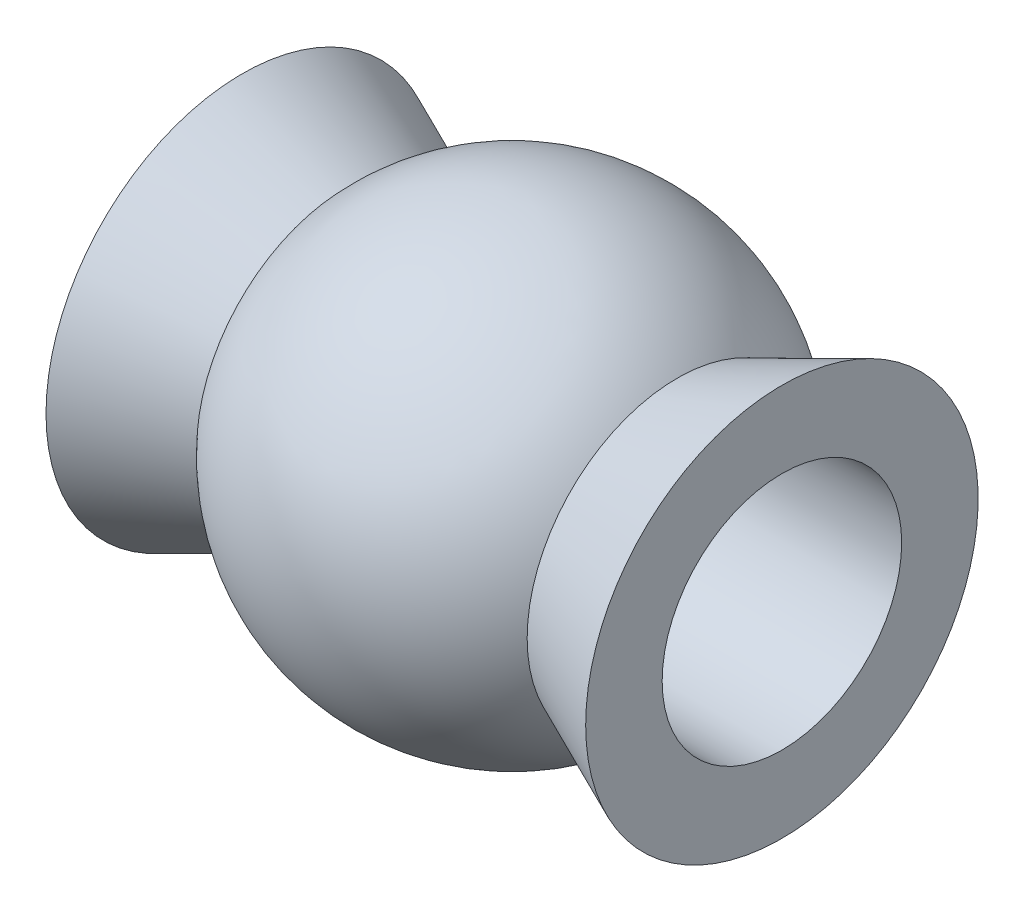
ISO-10303-21;
HEADER;
FILE_DESCRIPTION(('STEP AP214'),'2;1');
FILE_NAME('part.step','',(''),(''),'','','');
FILE_SCHEMA(('AUTOMOTIVE_DESIGN { 1 0 10303 214 1 1 1 1 }'));
ENDSEC;
DATA;
#1=APPLICATION_CONTEXT('core data for automotive mechanical design processes');
#2=APPLICATION_PROTOCOL_DEFINITION('international standard','automotive_design',2000,#1);
#3=PRODUCT_CONTEXT('',#1,'mechanical');
#4=PRODUCT('Part','Part','',(#3));
#5=PRODUCT_RELATED_PRODUCT_CATEGORY('part','',(#4));
#6=PRODUCT_DEFINITION_FORMATION('','',#4);
#7=PRODUCT_DEFINITION_CONTEXT('part definition',#1,'design');
#8=PRODUCT_DEFINITION('design','',#6,#7);
#9=PRODUCT_DEFINITION_SHAPE('','',#8);
#10=(LENGTH_UNIT() NAMED_UNIT(*) SI_UNIT(.MILLI.,.METRE.));
#11=(NAMED_UNIT(*) PLANE_ANGLE_UNIT() SI_UNIT($,.RADIAN.));
#12=(NAMED_UNIT(*) SI_UNIT($,.STERADIAN.) SOLID_ANGLE_UNIT());
#13=UNCERTAINTY_MEASURE_WITH_UNIT(LENGTH_MEASURE(1.E-05),#10,'distance_accuracy_value','');
#14=(GEOMETRIC_REPRESENTATION_CONTEXT(3) GLOBAL_UNCERTAINTY_ASSIGNED_CONTEXT((#13)) GLOBAL_UNIT_ASSIGNED_CONTEXT((#10,
#11,#12)) REPRESENTATION_CONTEXT('',''));
#15=CARTESIAN_POINT('',(0.,0.,0.));
#16=DIRECTION('',(0.,0.,1.));
#17=DIRECTION('',(1.,0.,0.));
#18=AXIS2_PLACEMENT_3D('',#15,#16,#17);
#19=CARTESIAN_POINT('',(0.,0.,0.));
#20=DIRECTION('',(-1.,0.,0.));
#21=DIRECTION('',(0.,0.,-1.));
#22=AXIS2_PLACEMENT_3D('',#19,#20,#21);
#23=SPHERICAL_SURFACE('',#22,2.88924999999999);
#24=CARTESIAN_POINT('',(-2.1382534818164,0.,0.));
#25=DIRECTION('',(-1.,0.,0.));
#26=DIRECTION('',(0.,0.,1.));
#27=AXIS2_PLACEMENT_3D('',#24,#25,#26);
#28=CIRCLE('',#27,1.9431);
#29=CARTESIAN_POINT('',(-2.1382534818164,0.,1.9431));
#30=VERTEX_POINT('',#29);
#31=EDGE_CURVE('E10',#30,#30,#28,.T.);
#32=ORIENTED_EDGE('',*,*,#31,.F.);
#33=EDGE_LOOP('',(#32));
#34=FACE_BOUND('',#33,.T.);
#35=CARTESIAN_POINT('',(2.13825348181641,0.,0.));
#36=DIRECTION('',(-1.,0.,0.));
#37=DIRECTION('',(0.,0.,1.));
#38=AXIS2_PLACEMENT_3D('',#35,#36,#37);
#39=CIRCLE('',#38,1.94309999999999);
#40=CARTESIAN_POINT('',(2.13825348181641,0.,1.94309999999999));
#41=VERTEX_POINT('',#40);
#42=EDGE_CURVE('E46',#41,#41,#39,.T.);
#43=ORIENTED_EDGE('',*,*,#42,.T.);
#44=EDGE_LOOP('',(#43));
#45=FACE_BOUND('',#44,.T.);
#46=ADVANCED_FACE('F30',(#34,#45),#23,.T.);
#47=CARTESIAN_POINT('',(-2.1382534818164,0.,0.));
#48=DIRECTION('',(-1.,0.,0.));
#49=DIRECTION('',(0.,0.,1.));
#50=AXIS2_PLACEMENT_3D('',#47,#48,#49);
#51=CONICAL_SURFACE('',#50,1.9431,0.415144850348437);
#52=CARTESIAN_POINT('',(-3.4925,0.,0.));
#53=DIRECTION('',(-1.,0.,0.));
#54=DIRECTION('',(0.,0.,1.));
#55=AXIS2_PLACEMENT_3D('',#52,#53,#54);
#56=CIRCLE('',#55,2.54);
#57=CARTESIAN_POINT('',(-3.49249999999999,0.,2.54000000000001));
#58=VERTEX_POINT('',#57);
#59=EDGE_CURVE('E37',#58,#58,#56,.T.);
#60=ORIENTED_EDGE('',*,*,#59,.F.);
#61=EDGE_LOOP('',(#60));
#62=FACE_BOUND('',#61,.T.);
#63=ORIENTED_EDGE('',*,*,#31,.T.);
#64=EDGE_LOOP('',(#63));
#65=FACE_BOUND('',#64,.T.);
#66=ADVANCED_FACE('F69',(#62,#65),#51,.T.);
#67=CARTESIAN_POINT('',(-3.4925,0.,-2.54));
#68=DIRECTION('',(1.,0.,0.));
#69=DIRECTION('',(0.,0.,-1.));
#70=AXIS2_PLACEMENT_3D('',#67,#68,#69);
#71=PLANE('',#70);
#72=CARTESIAN_POINT('',(-3.4925,0.,0.));
#73=DIRECTION('',(-1.,0.,0.));
#74=DIRECTION('',(0.,0.,1.));
#75=AXIS2_PLACEMENT_3D('',#72,#73,#74);
#76=CIRCLE('',#75,1.55);
#77=CARTESIAN_POINT('',(-3.4925,0.,1.55));
#78=VERTEX_POINT('',#77);
#79=EDGE_CURVE('E49',#78,#78,#76,.T.);
#80=ORIENTED_EDGE('',*,*,#79,.F.);
#81=EDGE_LOOP('',(#80));
#82=FACE_BOUND('',#81,.T.);
#83=ORIENTED_EDGE('',*,*,#59,.T.);
#84=EDGE_LOOP('',(#83));
#85=FACE_BOUND('',#84,.T.);
#86=ADVANCED_FACE('F74',(#82,#85),#71,.F.);
#87=CARTESIAN_POINT('',(3.49250000000001,0.,0.));
#88=DIRECTION('',(-1.,0.,0.));
#89=DIRECTION('',(0.,0.,1.));
#90=AXIS2_PLACEMENT_3D('',#87,#88,#89);
#91=PLANE('',#90);
#92=CARTESIAN_POINT('',(3.49250000000001,0.,0.));
#93=DIRECTION('',(-1.,0.,0.));
#94=DIRECTION('',(0.,0.,1.));
#95=AXIS2_PLACEMENT_3D('',#92,#93,#94);
#96=CIRCLE('',#95,1.55);
#97=CARTESIAN_POINT('',(3.49250000000001,0.,1.55));
#98=VERTEX_POINT('',#97);
#99=EDGE_CURVE('E33',#98,#98,#96,.T.);
#100=ORIENTED_EDGE('',*,*,#99,.T.);
#101=EDGE_LOOP('',(#100));
#102=FACE_BOUND('',#101,.T.);
#103=CARTESIAN_POINT('',(3.49250000000001,0.,0.));
#104=DIRECTION('',(-1.,0.,0.));
#105=DIRECTION('',(0.,0.,1.));
#106=AXIS2_PLACEMENT_3D('',#103,#104,#105);
#107=CIRCLE('',#106,2.54);
#108=CARTESIAN_POINT('',(3.49250000000001,0.,2.54));
#109=VERTEX_POINT('',#108);
#110=EDGE_CURVE('E41',#109,#109,#107,.T.);
#111=ORIENTED_EDGE('',*,*,#110,.F.);
#112=EDGE_LOOP('',(#111));
#113=FACE_BOUND('',#112,.T.);
#114=ADVANCED_FACE('F56',(#102,#113),#91,.F.);
#115=CARTESIAN_POINT('',(3.49250000000001,0.,0.));
#116=DIRECTION('',(1.,0.,0.));
#117=DIRECTION('',(0.,0.,-1.));
#118=AXIS2_PLACEMENT_3D('',#115,#116,#117);
#119=CONICAL_SURFACE('',#118,2.54,0.415144850348441);
#120=ORIENTED_EDGE('',*,*,#42,.F.);
#121=EDGE_LOOP('',(#120));
#122=FACE_BOUND('',#121,.T.);
#123=ORIENTED_EDGE('',*,*,#110,.T.);
#124=EDGE_LOOP('',(#123));
#125=FACE_BOUND('',#124,.T.);
#126=ADVANCED_FACE('F61',(#122,#125),#119,.T.);
#127=CARTESIAN_POINT('',(6.5075,0.,0.));
#128=DIRECTION('',(-1.,0.,0.));
#129=DIRECTION('',(0.,0.,1.));
#130=AXIS2_PLACEMENT_3D('',#127,#128,#129);
#131=CYLINDRICAL_SURFACE('',#130,1.55);
#132=ORIENTED_EDGE('',*,*,#79,.T.);
#133=EDGE_LOOP('',(#132));
#134=FACE_BOUND('',#133,.T.);
#135=ORIENTED_EDGE('',*,*,#99,.F.);
#136=EDGE_LOOP('',(#135));
#137=FACE_BOUND('',#136,.T.);
#138=ADVANCED_FACE('F59',(#134,#137),#131,.F.);
#139=CLOSED_SHELL('',(#46,#66,#86,#114,#126,#138));
#140=MANIFOLD_SOLID_BREP('B2',#139);
#141=ADVANCED_BREP_SHAPE_REPRESENTATION('',(#18,#140),#14);
#142=SHAPE_DEFINITION_REPRESENTATION(#9,#141);
ENDSEC;
END-ISO-10303-21;
